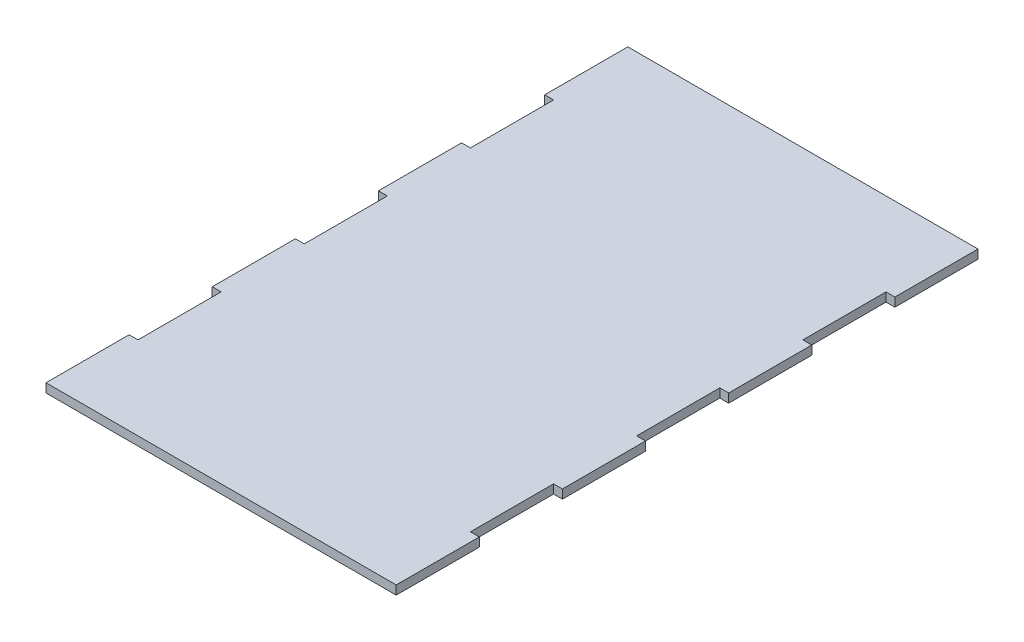
ISO-10303-21;
HEADER;
FILE_DESCRIPTION(('STEP AP214'),'2;1');
FILE_NAME('part.step','',(''),(''),'','','');
FILE_SCHEMA(('AUTOMOTIVE_DESIGN { 1 0 10303 214 1 1 1 1 }'));
ENDSEC;
DATA;
#1=APPLICATION_CONTEXT('core data for automotive mechanical design processes');
#2=APPLICATION_PROTOCOL_DEFINITION('international standard','automotive_design',2000,#1);
#3=PRODUCT_CONTEXT('',#1,'mechanical');
#4=PRODUCT('Part','Part','',(#3));
#5=PRODUCT_RELATED_PRODUCT_CATEGORY('part','',(#4));
#6=PRODUCT_DEFINITION_FORMATION('','',#4);
#7=PRODUCT_DEFINITION_CONTEXT('part definition',#1,'design');
#8=PRODUCT_DEFINITION('design','',#6,#7);
#9=PRODUCT_DEFINITION_SHAPE('','',#8);
#10=(LENGTH_UNIT() NAMED_UNIT(*) SI_UNIT(.MILLI.,.METRE.));
#11=(NAMED_UNIT(*) PLANE_ANGLE_UNIT() SI_UNIT($,.RADIAN.));
#12=(NAMED_UNIT(*) SI_UNIT($,.STERADIAN.) SOLID_ANGLE_UNIT());
#13=UNCERTAINTY_MEASURE_WITH_UNIT(LENGTH_MEASURE(1.E-05),#10,'distance_accuracy_value','');
#14=(GEOMETRIC_REPRESENTATION_CONTEXT(3) GLOBAL_UNCERTAINTY_ASSIGNED_CONTEXT((#13)) GLOBAL_UNIT_ASSIGNED_CONTEXT((#10,
#11,#12)) REPRESENTATION_CONTEXT('',''));
#15=CARTESIAN_POINT('',(0.,0.,0.));
#16=DIRECTION('',(0.,0.,1.));
#17=DIRECTION('',(1.,0.,0.));
#18=AXIS2_PLACEMENT_3D('',#15,#16,#17);
#19=CARTESIAN_POINT('',(0.,10.16,0.));
#20=DIRECTION('',(0.,0.,-1.));
#21=DIRECTION('',(-1.,0.,0.));
#22=AXIS2_PLACEMENT_3D('',#19,#20,#21);
#23=PLANE('',#22);
#24=DIRECTION('',(1.,0.,0.));
#25=VECTOR('',#24,1.);
#26=CARTESIAN_POINT('',(0.,0.,0.));
#27=LINE('',#26,#25);
#28=CARTESIAN_POINT('',(0.,0.,0.));
#29=VERTEX_POINT('',#28);
#30=CARTESIAN_POINT('',(401.32,0.,0.));
#31=VERTEX_POINT('',#30);
#32=EDGE_CURVE('E257',#29,#31,#27,.T.);
#33=ORIENTED_EDGE('',*,*,#32,.T.);
#34=DIRECTION('',(0.,-1.,0.));
#35=VECTOR('',#34,1.);
#36=CARTESIAN_POINT('',(401.32,10.16,0.));
#37=LINE('',#36,#35);
#38=CARTESIAN_POINT('',(401.32,10.16,0.));
#39=VERTEX_POINT('',#38);
#40=EDGE_CURVE('E11',#39,#31,#37,.T.);
#41=ORIENTED_EDGE('',*,*,#40,.F.);
#42=DIRECTION('',(1.,0.,0.));
#43=VECTOR('',#42,1.);
#44=CARTESIAN_POINT('',(0.,10.16,0.));
#45=LINE('',#44,#43);
#46=CARTESIAN_POINT('',(0.,10.16,0.));
#47=VERTEX_POINT('',#46);
#48=EDGE_CURVE('E324',#47,#39,#45,.T.);
#49=ORIENTED_EDGE('',*,*,#48,.F.);
#50=DIRECTION('',(0.,-1.,0.));
#51=VECTOR('',#50,1.);
#52=CARTESIAN_POINT('',(0.,10.16,0.));
#53=LINE('',#52,#51);
#54=EDGE_CURVE('E52',#47,#29,#53,.T.);
#55=ORIENTED_EDGE('',*,*,#54,.T.);
#56=EDGE_LOOP('',(#33,#41,#49,#55));
#57=FACE_BOUND('',#56,.T.);
#58=ADVANCED_FACE('F36',(#57),#23,.F.);
#59=CARTESIAN_POINT('',(401.32,10.16,0.));
#60=DIRECTION('',(-1.,0.,0.));
#61=DIRECTION('',(0.,0.,1.));
#62=AXIS2_PLACEMENT_3D('',#59,#60,#61);
#63=PLANE('',#62);
#64=DIRECTION('',(0.,0.,-1.));
#65=VECTOR('',#64,1.);
#66=CARTESIAN_POINT('',(401.32,0.,0.));
#67=LINE('',#66,#65);
#68=CARTESIAN_POINT('',(401.32,0.,-95.2500000000001));
#69=VERTEX_POINT('',#68);
#70=EDGE_CURVE('E259',#31,#69,#67,.T.);
#71=ORIENTED_EDGE('',*,*,#70,.T.);
#72=DIRECTION('',(0.,-1.,0.));
#73=VECTOR('',#72,1.);
#74=CARTESIAN_POINT('',(401.32,10.16,-95.2500000000001));
#75=LINE('',#74,#73);
#76=CARTESIAN_POINT('',(401.32,10.16,-95.2500000000001));
#77=VERTEX_POINT('',#76);
#78=EDGE_CURVE('E44',#77,#69,#75,.T.);
#79=ORIENTED_EDGE('',*,*,#78,.F.);
#80=DIRECTION('',(0.,0.,-1.));
#81=VECTOR('',#80,1.);
#82=CARTESIAN_POINT('',(401.32,10.16,0.));
#83=LINE('',#82,#81);
#84=EDGE_CURVE('E150',#39,#77,#83,.T.);
#85=ORIENTED_EDGE('',*,*,#84,.F.);
#86=ORIENTED_EDGE('',*,*,#40,.T.);
#87=EDGE_LOOP('',(#71,#79,#85,#86));
#88=FACE_BOUND('',#87,.T.);
#89=ADVANCED_FACE('F468',(#88),#63,.F.);
#90=CARTESIAN_POINT('',(-1.30104260698259E-13,10.16,-95.2499999999995));
#91=DIRECTION('',(0.,0.,1.));
#92=DIRECTION('',(1.,0.,0.));
#93=AXIS2_PLACEMENT_3D('',#90,#91,#92);
#94=PLANE('',#93);
#95=DIRECTION('',(-1.,0.,0.));
#96=VECTOR('',#95,1.);
#97=CARTESIAN_POINT('',(-1.30104260698259E-13,0.,-95.2499999999995));
#98=LINE('',#97,#96);
#99=CARTESIAN_POINT('',(391.16,0.,-95.25));
#100=VERTEX_POINT('',#99);
#101=EDGE_CURVE('E261',#69,#100,#98,.T.);
#102=ORIENTED_EDGE('',*,*,#101,.T.);
#103=DIRECTION('',(0.,-1.,0.));
#104=VECTOR('',#103,1.);
#105=CARTESIAN_POINT('',(391.16,10.16,-95.25));
#106=LINE('',#105,#104);
#107=CARTESIAN_POINT('',(391.16,10.16,-95.25));
#108=VERTEX_POINT('',#107);
#109=EDGE_CURVE('E374',#108,#100,#106,.T.);
#110=ORIENTED_EDGE('',*,*,#109,.F.);
#111=DIRECTION('',(-1.,0.,0.));
#112=VECTOR('',#111,1.);
#113=CARTESIAN_POINT('',(-1.30104260698259E-13,10.16,-95.2499999999995));
#114=LINE('',#113,#112);
#115=EDGE_CURVE('E381',#77,#108,#114,.T.);
#116=ORIENTED_EDGE('',*,*,#115,.F.);
#117=ORIENTED_EDGE('',*,*,#78,.T.);
#118=EDGE_LOOP('',(#102,#110,#116,#117));
#119=FACE_BOUND('',#118,.T.);
#120=ADVANCED_FACE('F379',(#119),#94,.F.);
#121=CARTESIAN_POINT('',(391.16,10.16,0.));
#122=DIRECTION('',(1.,0.,0.));
#123=DIRECTION('',(0.,0.,-1.));
#124=AXIS2_PLACEMENT_3D('',#121,#122,#123);
#125=PLANE('',#124);
#126=DIRECTION('',(0.,0.,1.));
#127=VECTOR('',#126,1.);
#128=CARTESIAN_POINT('',(391.16,0.,0.));
#129=LINE('',#128,#127);
#130=CARTESIAN_POINT('',(391.16,0.,-190.5));
#131=VERTEX_POINT('',#130);
#132=EDGE_CURVE('E264',#131,#100,#129,.T.);
#133=ORIENTED_EDGE('',*,*,#132,.F.);
#134=DIRECTION('',(0.,-1.,0.));
#135=VECTOR('',#134,1.);
#136=CARTESIAN_POINT('',(391.16,10.16,-190.5));
#137=LINE('',#136,#135);
#138=CARTESIAN_POINT('',(391.16,10.16,-190.5));
#139=VERTEX_POINT('',#138);
#140=EDGE_CURVE('E372',#139,#131,#137,.T.);
#141=ORIENTED_EDGE('',*,*,#140,.F.);
#142=DIRECTION('',(0.,0.,1.));
#143=VECTOR('',#142,1.);
#144=CARTESIAN_POINT('',(391.16,10.16,0.));
#145=LINE('',#144,#143);
#146=EDGE_CURVE('E391',#139,#108,#145,.T.);
#147=ORIENTED_EDGE('',*,*,#146,.T.);
#148=ORIENTED_EDGE('',*,*,#109,.T.);
#149=EDGE_LOOP('',(#133,#141,#147,#148));
#150=FACE_BOUND('',#149,.T.);
#151=ADVANCED_FACE('F388',(#150),#125,.T.);
#152=CARTESIAN_POINT('',(0.,10.16,-190.5));
#153=DIRECTION('',(0.,0.,1.));
#154=DIRECTION('',(1.,0.,0.));
#155=AXIS2_PLACEMENT_3D('',#152,#153,#154);
#156=PLANE('',#155);
#157=DIRECTION('',(-1.,0.,0.));
#158=VECTOR('',#157,1.);
#159=CARTESIAN_POINT('',(0.,0.,-190.5));
#160=LINE('',#159,#158);
#161=CARTESIAN_POINT('',(401.32,0.,-190.5));
#162=VERTEX_POINT('',#161);
#163=EDGE_CURVE('E267',#162,#131,#160,.T.);
#164=ORIENTED_EDGE('',*,*,#163,.F.);
#165=DIRECTION('',(0.,-1.,0.));
#166=VECTOR('',#165,1.);
#167=CARTESIAN_POINT('',(401.32,10.16,-190.5));
#168=LINE('',#167,#166);
#169=CARTESIAN_POINT('',(401.32,10.16,-190.5));
#170=VERTEX_POINT('',#169);
#171=EDGE_CURVE('E370',#170,#162,#168,.T.);
#172=ORIENTED_EDGE('',*,*,#171,.F.);
#173=DIRECTION('',(-1.,0.,0.));
#174=VECTOR('',#173,1.);
#175=CARTESIAN_POINT('',(0.,10.16,-190.5));
#176=LINE('',#175,#174);
#177=EDGE_CURVE('E394',#170,#139,#176,.T.);
#178=ORIENTED_EDGE('',*,*,#177,.T.);
#179=ORIENTED_EDGE('',*,*,#140,.T.);
#180=EDGE_LOOP('',(#164,#172,#178,#179));
#181=FACE_BOUND('',#180,.T.);
#182=ADVANCED_FACE('F721',(#181),#156,.T.);
#183=CARTESIAN_POINT('',(401.32,10.16,0.));
#184=DIRECTION('',(-1.,0.,0.));
#185=DIRECTION('',(0.,0.,1.));
#186=AXIS2_PLACEMENT_3D('',#183,#184,#185);
#187=PLANE('',#186);
#188=DIRECTION('',(0.,0.,-1.));
#189=VECTOR('',#188,1.);
#190=CARTESIAN_POINT('',(401.32,0.,0.));
#191=LINE('',#190,#189);
#192=CARTESIAN_POINT('',(401.32,0.,-285.75));
#193=VERTEX_POINT('',#192);
#194=EDGE_CURVE('E272',#162,#193,#191,.T.);
#195=ORIENTED_EDGE('',*,*,#194,.T.);
#196=DIRECTION('',(0.,-1.,0.));
#197=VECTOR('',#196,1.);
#198=CARTESIAN_POINT('',(401.32,10.16,-285.75));
#199=LINE('',#198,#197);
#200=CARTESIAN_POINT('',(401.32,10.16,-285.75));
#201=VERTEX_POINT('',#200);
#202=EDGE_CURVE('E367',#201,#193,#199,.T.);
#203=ORIENTED_EDGE('',*,*,#202,.F.);
#204=DIRECTION('',(0.,0.,-1.));
#205=VECTOR('',#204,1.);
#206=CARTESIAN_POINT('',(401.32,10.16,0.));
#207=LINE('',#206,#205);
#208=EDGE_CURVE('E398',#170,#201,#207,.T.);
#209=ORIENTED_EDGE('',*,*,#208,.F.);
#210=ORIENTED_EDGE('',*,*,#171,.T.);
#211=EDGE_LOOP('',(#195,#203,#209,#210));
#212=FACE_BOUND('',#211,.T.);
#213=ADVANCED_FACE('F709',(#212),#187,.F.);
#214=CARTESIAN_POINT('',(0.,10.16,-285.75));
#215=DIRECTION('',(0.,0.,1.));
#216=DIRECTION('',(1.,0.,0.));
#217=AXIS2_PLACEMENT_3D('',#214,#215,#216);
#218=PLANE('',#217);
#219=DIRECTION('',(-1.,0.,0.));
#220=VECTOR('',#219,1.);
#221=CARTESIAN_POINT('',(0.,0.,-285.75));
#222=LINE('',#221,#220);
#223=CARTESIAN_POINT('',(391.16,0.,-285.75));
#224=VERTEX_POINT('',#223);
#225=EDGE_CURVE('E274',#193,#224,#222,.T.);
#226=ORIENTED_EDGE('',*,*,#225,.T.);
#227=DIRECTION('',(0.,-1.,0.));
#228=VECTOR('',#227,1.);
#229=CARTESIAN_POINT('',(391.16,10.16,-285.75));
#230=LINE('',#229,#228);
#231=CARTESIAN_POINT('',(391.16,10.16,-285.75));
#232=VERTEX_POINT('',#231);
#233=EDGE_CURVE('E365',#232,#224,#230,.T.);
#234=ORIENTED_EDGE('',*,*,#233,.F.);
#235=DIRECTION('',(-1.,0.,0.));
#236=VECTOR('',#235,1.);
#237=CARTESIAN_POINT('',(0.,10.16,-285.75));
#238=LINE('',#237,#236);
#239=EDGE_CURVE('E406',#201,#232,#238,.T.);
#240=ORIENTED_EDGE('',*,*,#239,.F.);
#241=ORIENTED_EDGE('',*,*,#202,.T.);
#242=EDGE_LOOP('',(#226,#234,#240,#241));
#243=FACE_BOUND('',#242,.T.);
#244=ADVANCED_FACE('F700',(#243),#218,.F.);
#245=CARTESIAN_POINT('',(391.16,0.,-381.));
#246=VERTEX_POINT('',#245);
#247=EDGE_CURVE('E269',#246,#224,#129,.T.);
#248=ORIENTED_EDGE('',*,*,#247,.F.);
#249=DIRECTION('',(0.,-1.,0.));
#250=VECTOR('',#249,1.);
#251=CARTESIAN_POINT('',(391.16,10.16,-381.));
#252=LINE('',#251,#250);
#253=CARTESIAN_POINT('',(391.16,10.16,-381.));
#254=VERTEX_POINT('',#253);
#255=EDGE_CURVE('E363',#254,#246,#252,.T.);
#256=ORIENTED_EDGE('',*,*,#255,.F.);
#257=EDGE_CURVE('E397',#254,#232,#145,.T.);
#258=ORIENTED_EDGE('',*,*,#257,.T.);
#259=ORIENTED_EDGE('',*,*,#233,.T.);
#260=EDGE_LOOP('',(#248,#256,#258,#259));
#261=FACE_BOUND('',#260,.T.);
#262=ADVANCED_FACE('F657',(#261),#125,.T.);
#263=CARTESIAN_POINT('',(0.,10.16,-381.));
#264=DIRECTION('',(0.,0.,1.));
#265=DIRECTION('',(1.,0.,0.));
#266=AXIS2_PLACEMENT_3D('',#263,#264,#265);
#267=PLANE('',#266);
#268=DIRECTION('',(-1.,0.,0.));
#269=VECTOR('',#268,1.);
#270=CARTESIAN_POINT('',(0.,0.,-381.));
#271=LINE('',#270,#269);
#272=CARTESIAN_POINT('',(401.32,0.,-381.));
#273=VERTEX_POINT('',#272);
#274=EDGE_CURVE('E277',#273,#246,#271,.T.);
#275=ORIENTED_EDGE('',*,*,#274,.F.);
#276=DIRECTION('',(0.,-1.,0.));
#277=VECTOR('',#276,1.);
#278=CARTESIAN_POINT('',(401.32,10.16,-381.));
#279=LINE('',#278,#277);
#280=CARTESIAN_POINT('',(401.32,10.16,-381.));
#281=VERTEX_POINT('',#280);
#282=EDGE_CURVE('E361',#281,#273,#279,.T.);
#283=ORIENTED_EDGE('',*,*,#282,.F.);
#284=DIRECTION('',(-1.,0.,0.));
#285=VECTOR('',#284,1.);
#286=CARTESIAN_POINT('',(0.,10.16,-381.));
#287=LINE('',#286,#285);
#288=EDGE_CURVE('E405',#281,#254,#287,.T.);
#289=ORIENTED_EDGE('',*,*,#288,.T.);
#290=ORIENTED_EDGE('',*,*,#255,.T.);
#291=EDGE_LOOP('',(#275,#283,#289,#290));
#292=FACE_BOUND('',#291,.T.);
#293=ADVANCED_FACE('F678',(#292),#267,.T.);
#294=CARTESIAN_POINT('',(401.32,10.16,0.));
#295=DIRECTION('',(-1.,0.,0.));
#296=DIRECTION('',(0.,0.,1.));
#297=AXIS2_PLACEMENT_3D('',#294,#295,#296);
#298=PLANE('',#297);
#299=DIRECTION('',(0.,0.,-1.));
#300=VECTOR('',#299,1.);
#301=CARTESIAN_POINT('',(401.32,0.,0.));
#302=LINE('',#301,#300);
#303=CARTESIAN_POINT('',(401.32,0.,-476.25));
#304=VERTEX_POINT('',#303);
#305=EDGE_CURVE('E280',#273,#304,#302,.T.);
#306=ORIENTED_EDGE('',*,*,#305,.T.);
#307=DIRECTION('',(0.,-1.,0.));
#308=VECTOR('',#307,1.);
#309=CARTESIAN_POINT('',(401.32,10.16,-476.25));
#310=LINE('',#309,#308);
#311=CARTESIAN_POINT('',(401.32,10.16,-476.25));
#312=VERTEX_POINT('',#311);
#313=EDGE_CURVE('E358',#312,#304,#310,.T.);
#314=ORIENTED_EDGE('',*,*,#313,.F.);
#315=DIRECTION('',(0.,0.,-1.));
#316=VECTOR('',#315,1.);
#317=CARTESIAN_POINT('',(401.32,10.16,0.));
#318=LINE('',#317,#316);
#319=EDGE_CURVE('E410',#281,#312,#318,.T.);
#320=ORIENTED_EDGE('',*,*,#319,.F.);
#321=ORIENTED_EDGE('',*,*,#282,.T.);
#322=EDGE_LOOP('',(#306,#314,#320,#321));
#323=FACE_BOUND('',#322,.T.);
#324=ADVANCED_FACE('F666',(#323),#298,.F.);
#325=CARTESIAN_POINT('',(0.,10.16,-476.25));
#326=DIRECTION('',(0.,0.,1.));
#327=DIRECTION('',(1.,0.,0.));
#328=AXIS2_PLACEMENT_3D('',#325,#326,#327);
#329=PLANE('',#328);
#330=DIRECTION('',(-1.,0.,0.));
#331=VECTOR('',#330,1.);
#332=CARTESIAN_POINT('',(0.,0.,-476.25));
#333=LINE('',#332,#331);
#334=CARTESIAN_POINT('',(391.16,0.,-476.25));
#335=VERTEX_POINT('',#334);
#336=EDGE_CURVE('E282',#304,#335,#333,.T.);
#337=ORIENTED_EDGE('',*,*,#336,.T.);
#338=DIRECTION('',(0.,-1.,0.));
#339=VECTOR('',#338,1.);
#340=CARTESIAN_POINT('',(391.16,10.16,-476.25));
#341=LINE('',#340,#339);
#342=CARTESIAN_POINT('',(391.16,10.16,-476.25));
#343=VERTEX_POINT('',#342);
#344=EDGE_CURVE('E356',#343,#335,#341,.T.);
#345=ORIENTED_EDGE('',*,*,#344,.F.);
#346=DIRECTION('',(-1.,0.,0.));
#347=VECTOR('',#346,1.);
#348=CARTESIAN_POINT('',(0.,10.16,-476.25));
#349=LINE('',#348,#347);
#350=EDGE_CURVE('E403',#312,#343,#349,.T.);
#351=ORIENTED_EDGE('',*,*,#350,.F.);
#352=ORIENTED_EDGE('',*,*,#313,.T.);
#353=EDGE_LOOP('',(#337,#345,#351,#352));
#354=FACE_BOUND('',#353,.T.);
#355=ADVANCED_FACE('F654',(#354),#329,.F.);
#356=CARTESIAN_POINT('',(391.16,0.,-571.5));
#357=VERTEX_POINT('',#356);
#358=EDGE_CURVE('E268',#357,#335,#129,.T.);
#359=ORIENTED_EDGE('',*,*,#358,.F.);
#360=DIRECTION('',(0.,-1.,0.));
#361=VECTOR('',#360,1.);
#362=CARTESIAN_POINT('',(391.16,10.16,-571.5));
#363=LINE('',#362,#361);
#364=CARTESIAN_POINT('',(391.16,10.16,-571.5));
#365=VERTEX_POINT('',#364);
#366=EDGE_CURVE('E354',#365,#357,#363,.T.);
#367=ORIENTED_EDGE('',*,*,#366,.F.);
#368=EDGE_CURVE('E396',#365,#343,#145,.T.);
#369=ORIENTED_EDGE('',*,*,#368,.T.);
#370=ORIENTED_EDGE('',*,*,#344,.T.);
#371=EDGE_LOOP('',(#359,#367,#369,#370));
#372=FACE_BOUND('',#371,.T.);
#373=ADVANCED_FACE('F642',(#372),#125,.T.);
#374=CARTESIAN_POINT('',(0.,10.16,-571.5));
#375=DIRECTION('',(0.,0.,1.));
#376=DIRECTION('',(1.,0.,0.));
#377=AXIS2_PLACEMENT_3D('',#374,#375,#376);
#378=PLANE('',#377);
#379=DIRECTION('',(-1.,0.,0.));
#380=VECTOR('',#379,1.);
#381=CARTESIAN_POINT('',(0.,0.,-571.5));
#382=LINE('',#381,#380);
#383=CARTESIAN_POINT('',(401.32,0.,-571.5));
#384=VERTEX_POINT('',#383);
#385=EDGE_CURVE('E285',#384,#357,#382,.T.);
#386=ORIENTED_EDGE('',*,*,#385,.F.);
#387=DIRECTION('',(0.,-1.,0.));
#388=VECTOR('',#387,1.);
#389=CARTESIAN_POINT('',(401.32,10.16,-571.5));
#390=LINE('',#389,#388);
#391=CARTESIAN_POINT('',(401.32,10.16,-571.5));
#392=VERTEX_POINT('',#391);
#393=EDGE_CURVE('E352',#392,#384,#390,.T.);
#394=ORIENTED_EDGE('',*,*,#393,.F.);
#395=DIRECTION('',(-1.,0.,0.));
#396=VECTOR('',#395,1.);
#397=CARTESIAN_POINT('',(0.,10.16,-571.5));
#398=LINE('',#397,#396);
#399=EDGE_CURVE('E402',#392,#365,#398,.T.);
#400=ORIENTED_EDGE('',*,*,#399,.T.);
#401=ORIENTED_EDGE('',*,*,#366,.T.);
#402=EDGE_LOOP('',(#386,#394,#400,#401));
#403=FACE_BOUND('',#402,.T.);
#404=ADVANCED_FACE('F630',(#403),#378,.T.);
#405=CARTESIAN_POINT('',(401.32,10.16,0.));
#406=DIRECTION('',(-1.,0.,0.));
#407=DIRECTION('',(0.,0.,1.));
#408=AXIS2_PLACEMENT_3D('',#405,#406,#407);
#409=PLANE('',#408);
#410=DIRECTION('',(0.,0.,-1.));
#411=VECTOR('',#410,1.);
#412=CARTESIAN_POINT('',(401.32,0.,0.));
#413=LINE('',#412,#411);
#414=CARTESIAN_POINT('',(401.32,0.,-666.75));
#415=VERTEX_POINT('',#414);
#416=EDGE_CURVE('E288',#384,#415,#413,.T.);
#417=ORIENTED_EDGE('',*,*,#416,.T.);
#418=DIRECTION('',(0.,-1.,0.));
#419=VECTOR('',#418,1.);
#420=CARTESIAN_POINT('',(401.32,10.16,-666.75));
#421=LINE('',#420,#419);
#422=CARTESIAN_POINT('',(401.32,10.16,-666.75));
#423=VERTEX_POINT('',#422);
#424=EDGE_CURVE('E350',#423,#415,#421,.T.);
#425=ORIENTED_EDGE('',*,*,#424,.F.);
#426=DIRECTION('',(0.,0.,-1.));
#427=VECTOR('',#426,1.);
#428=CARTESIAN_POINT('',(401.32,10.16,0.));
#429=LINE('',#428,#427);
#430=EDGE_CURVE('E421',#392,#423,#429,.T.);
#431=ORIENTED_EDGE('',*,*,#430,.F.);
#432=ORIENTED_EDGE('',*,*,#393,.T.);
#433=EDGE_LOOP('',(#417,#425,#431,#432));
#434=FACE_BOUND('',#433,.T.);
#435=ADVANCED_FACE('F619',(#434),#409,.F.);
#436=CARTESIAN_POINT('',(0.,10.16,-666.75));
#437=DIRECTION('',(0.,0.,-1.));
#438=DIRECTION('',(-1.,0.,0.));
#439=AXIS2_PLACEMENT_3D('',#436,#437,#438);
#440=PLANE('',#439);
#441=DIRECTION('',(1.,0.,0.));
#442=VECTOR('',#441,1.);
#443=CARTESIAN_POINT('',(0.,0.,-666.75));
#444=LINE('',#443,#442);
#445=CARTESIAN_POINT('',(0.,0.,-666.75));
#446=VERTEX_POINT('',#445);
#447=EDGE_CURVE('E291',#446,#415,#444,.T.);
#448=ORIENTED_EDGE('',*,*,#447,.F.);
#449=DIRECTION('',(0.,-1.,0.));
#450=VECTOR('',#449,1.);
#451=CARTESIAN_POINT('',(0.,10.16,-666.75));
#452=LINE('',#451,#450);
#453=CARTESIAN_POINT('',(0.,10.16,-666.75));
#454=VERTEX_POINT('',#453);
#455=EDGE_CURVE('E348',#454,#446,#452,.T.);
#456=ORIENTED_EDGE('',*,*,#455,.F.);
#457=DIRECTION('',(1.,0.,0.));
#458=VECTOR('',#457,1.);
#459=CARTESIAN_POINT('',(0.,10.16,-666.75));
#460=LINE('',#459,#458);
#461=EDGE_CURVE('E423',#454,#423,#460,.T.);
#462=ORIENTED_EDGE('',*,*,#461,.T.);
#463=ORIENTED_EDGE('',*,*,#424,.T.);
#464=EDGE_LOOP('',(#448,#456,#462,#463));
#465=FACE_BOUND('',#464,.T.);
#466=ADVANCED_FACE('F608',(#465),#440,.T.);
#467=CARTESIAN_POINT('',(0.,10.16,0.));
#468=DIRECTION('',(-1.,0.,0.));
#469=DIRECTION('',(0.,0.,1.));
#470=AXIS2_PLACEMENT_3D('',#467,#468,#469);
#471=PLANE('',#470);
#472=DIRECTION('',(0.,0.,-1.));
#473=VECTOR('',#472,1.);
#474=CARTESIAN_POINT('',(0.,0.,0.));
#475=LINE('',#474,#473);
#476=CARTESIAN_POINT('',(0.,0.,-571.5));
#477=VERTEX_POINT('',#476);
#478=EDGE_CURVE('E294',#477,#446,#475,.T.);
#479=ORIENTED_EDGE('',*,*,#478,.F.);
#480=DIRECTION('',(0.,-1.,0.));
#481=VECTOR('',#480,1.);
#482=CARTESIAN_POINT('',(0.,10.16,-571.5));
#483=LINE('',#482,#481);
#484=CARTESIAN_POINT('',(0.,10.16,-571.5));
#485=VERTEX_POINT('',#484);
#486=EDGE_CURVE('E346',#485,#477,#483,.T.);
#487=ORIENTED_EDGE('',*,*,#486,.F.);
#488=DIRECTION('',(0.,0.,-1.));
#489=VECTOR('',#488,1.);
#490=CARTESIAN_POINT('',(0.,10.16,0.));
#491=LINE('',#490,#489);
#492=EDGE_CURVE('E426',#485,#454,#491,.T.);
#493=ORIENTED_EDGE('',*,*,#492,.T.);
#494=ORIENTED_EDGE('',*,*,#455,.T.);
#495=EDGE_LOOP('',(#479,#487,#493,#494));
#496=FACE_BOUND('',#495,.T.);
#497=ADVANCED_FACE('F596',(#496),#471,.T.);
#498=CARTESIAN_POINT('',(0.,10.16,-571.5));
#499=DIRECTION('',(0.,0.,-1.));
#500=DIRECTION('',(-1.,0.,0.));
#501=AXIS2_PLACEMENT_3D('',#498,#499,#500);
#502=PLANE('',#501);
#503=DIRECTION('',(1.,0.,0.));
#504=VECTOR('',#503,1.);
#505=CARTESIAN_POINT('',(0.,0.,-571.5));
#506=LINE('',#505,#504);
#507=CARTESIAN_POINT('',(10.16,0.,-571.5));
#508=VERTEX_POINT('',#507);
#509=EDGE_CURVE('E297',#477,#508,#506,.T.);
#510=ORIENTED_EDGE('',*,*,#509,.T.);
#511=DIRECTION('',(0.,-1.,0.));
#512=VECTOR('',#511,1.);
#513=CARTESIAN_POINT('',(10.16,10.16,-571.5));
#514=LINE('',#513,#512);
#515=CARTESIAN_POINT('',(10.16,10.16,-571.5));
#516=VERTEX_POINT('',#515);
#517=EDGE_CURVE('E343',#516,#508,#514,.T.);
#518=ORIENTED_EDGE('',*,*,#517,.F.);
#519=DIRECTION('',(1.,0.,0.));
#520=VECTOR('',#519,1.);
#521=CARTESIAN_POINT('',(0.,10.16,-571.5));
#522=LINE('',#521,#520);
#523=EDGE_CURVE('E429',#485,#516,#522,.T.);
#524=ORIENTED_EDGE('',*,*,#523,.F.);
#525=ORIENTED_EDGE('',*,*,#486,.T.);
#526=EDGE_LOOP('',(#510,#518,#524,#525));
#527=FACE_BOUND('',#526,.T.);
#528=ADVANCED_FACE('F586',(#527),#502,.F.);
#529=CARTESIAN_POINT('',(10.1600000000001,10.16,0.));
#530=DIRECTION('',(1.,0.,0.));
#531=DIRECTION('',(0.,0.,-1.));
#532=AXIS2_PLACEMENT_3D('',#529,#530,#531);
#533=PLANE('',#532);
#534=DIRECTION('',(0.,0.,1.));
#535=VECTOR('',#534,1.);
#536=CARTESIAN_POINT('',(10.1600000000001,0.,0.));
#537=LINE('',#536,#535);
#538=CARTESIAN_POINT('',(10.16,0.,-476.25));
#539=VERTEX_POINT('',#538);
#540=EDGE_CURVE('E299',#508,#539,#537,.T.);
#541=ORIENTED_EDGE('',*,*,#540,.T.);
#542=DIRECTION('',(0.,-1.,0.));
#543=VECTOR('',#542,1.);
#544=CARTESIAN_POINT('',(10.16,10.16,-476.25));
#545=LINE('',#544,#543);
#546=CARTESIAN_POINT('',(10.16,10.16,-476.25));
#547=VERTEX_POINT('',#546);
#548=EDGE_CURVE('E341',#547,#539,#545,.T.);
#549=ORIENTED_EDGE('',*,*,#548,.F.);
#550=DIRECTION('',(0.,0.,1.));
#551=VECTOR('',#550,1.);
#552=CARTESIAN_POINT('',(10.1600000000001,10.16,0.));
#553=LINE('',#552,#551);
#554=EDGE_CURVE('E240',#516,#547,#553,.T.);
#555=ORIENTED_EDGE('',*,*,#554,.F.);
#556=ORIENTED_EDGE('',*,*,#517,.T.);
#557=EDGE_LOOP('',(#541,#549,#555,#556));
#558=FACE_BOUND('',#557,.T.);
#559=ADVANCED_FACE('F464',(#558),#533,.F.);
#560=CARTESIAN_POINT('',(0.,10.16,-476.25));
#561=DIRECTION('',(0.,0.,-1.));
#562=DIRECTION('',(-1.,0.,0.));
#563=AXIS2_PLACEMENT_3D('',#560,#561,#562);
#564=PLANE('',#563);
#565=DIRECTION('',(1.,0.,0.));
#566=VECTOR('',#565,1.);
#567=CARTESIAN_POINT('',(0.,0.,-476.25));
#568=LINE('',#567,#566);
#569=CARTESIAN_POINT('',(0.,0.,-476.25));
#570=VERTEX_POINT('',#569);
#571=EDGE_CURVE('E302',#570,#539,#568,.T.);
#572=ORIENTED_EDGE('',*,*,#571,.F.);
#573=DIRECTION('',(0.,-1.,0.));
#574=VECTOR('',#573,1.);
#575=CARTESIAN_POINT('',(0.,10.16,-476.25));
#576=LINE('',#575,#574);
#577=CARTESIAN_POINT('',(0.,10.16,-476.25));
#578=VERTEX_POINT('',#577);
#579=EDGE_CURVE('E339',#578,#570,#576,.T.);
#580=ORIENTED_EDGE('',*,*,#579,.F.);
#581=DIRECTION('',(1.,0.,0.));
#582=VECTOR('',#581,1.);
#583=CARTESIAN_POINT('',(0.,10.16,-476.25));
#584=LINE('',#583,#582);
#585=EDGE_CURVE('E431',#578,#547,#584,.T.);
#586=ORIENTED_EDGE('',*,*,#585,.T.);
#587=ORIENTED_EDGE('',*,*,#548,.T.);
#588=EDGE_LOOP('',(#572,#580,#586,#587));
#589=FACE_BOUND('',#588,.T.);
#590=ADVANCED_FACE('F565',(#589),#564,.T.);
#591=CARTESIAN_POINT('',(0.,10.16,0.));
#592=DIRECTION('',(-1.,0.,0.));
#593=DIRECTION('',(0.,0.,1.));
#594=AXIS2_PLACEMENT_3D('',#591,#592,#593);
#595=PLANE('',#594);
#596=DIRECTION('',(0.,0.,-1.));
#597=VECTOR('',#596,1.);
#598=CARTESIAN_POINT('',(0.,0.,0.));
#599=LINE('',#598,#597);
#600=CARTESIAN_POINT('',(0.,0.,-381.));
#601=VERTEX_POINT('',#600);
#602=EDGE_CURVE('E306',#601,#570,#599,.T.);
#603=ORIENTED_EDGE('',*,*,#602,.F.);
#604=DIRECTION('',(0.,-1.,0.));
#605=VECTOR('',#604,1.);
#606=CARTESIAN_POINT('',(0.,10.16,-381.));
#607=LINE('',#606,#605);
#608=CARTESIAN_POINT('',(0.,10.16,-381.));
#609=VERTEX_POINT('',#608);
#610=EDGE_CURVE('E337',#609,#601,#607,.T.);
#611=ORIENTED_EDGE('',*,*,#610,.F.);
#612=DIRECTION('',(0.,0.,-1.));
#613=VECTOR('',#612,1.);
#614=CARTESIAN_POINT('',(0.,10.16,0.));
#615=LINE('',#614,#613);
#616=EDGE_CURVE('E434',#609,#578,#615,.T.);
#617=ORIENTED_EDGE('',*,*,#616,.T.);
#618=ORIENTED_EDGE('',*,*,#579,.T.);
#619=EDGE_LOOP('',(#603,#611,#617,#618));
#620=FACE_BOUND('',#619,.T.);
#621=ADVANCED_FACE('F553',(#620),#595,.T.);
#622=CARTESIAN_POINT('',(0.,10.16,-381.));
#623=DIRECTION('',(0.,0.,-1.));
#624=DIRECTION('',(-1.,0.,0.));
#625=AXIS2_PLACEMENT_3D('',#622,#623,#624);
#626=PLANE('',#625);
#627=DIRECTION('',(1.,0.,0.));
#628=VECTOR('',#627,1.);
#629=CARTESIAN_POINT('',(0.,0.,-381.));
#630=LINE('',#629,#628);
#631=CARTESIAN_POINT('',(10.16,0.,-381.));
#632=VERTEX_POINT('',#631);
#633=EDGE_CURVE('E309',#601,#632,#630,.T.);
#634=ORIENTED_EDGE('',*,*,#633,.T.);
#635=DIRECTION('',(0.,-1.,0.));
#636=VECTOR('',#635,1.);
#637=CARTESIAN_POINT('',(10.16,10.16,-381.));
#638=LINE('',#637,#636);
#639=CARTESIAN_POINT('',(10.16,10.16,-381.));
#640=VERTEX_POINT('',#639);
#641=EDGE_CURVE('E334',#640,#632,#638,.T.);
#642=ORIENTED_EDGE('',*,*,#641,.F.);
#643=DIRECTION('',(1.,0.,0.));
#644=VECTOR('',#643,1.);
#645=CARTESIAN_POINT('',(0.,10.16,-381.));
#646=LINE('',#645,#644);
#647=EDGE_CURVE('E437',#609,#640,#646,.T.);
#648=ORIENTED_EDGE('',*,*,#647,.F.);
#649=ORIENTED_EDGE('',*,*,#610,.T.);
#650=EDGE_LOOP('',(#634,#642,#648,#649));
#651=FACE_BOUND('',#650,.T.);
#652=ADVANCED_FACE('F543',(#651),#626,.F.);
#653=CARTESIAN_POINT('',(10.16,0.,-285.75));
#654=VERTEX_POINT('',#653);
#655=EDGE_CURVE('E303',#632,#654,#537,.T.);
#656=ORIENTED_EDGE('',*,*,#655,.T.);
#657=DIRECTION('',(0.,-1.,0.));
#658=VECTOR('',#657,1.);
#659=CARTESIAN_POINT('',(10.16,10.16,-285.75));
#660=LINE('',#659,#658);
#661=CARTESIAN_POINT('',(10.16,10.16,-285.75));
#662=VERTEX_POINT('',#661);
#663=EDGE_CURVE('E332',#662,#654,#660,.T.);
#664=ORIENTED_EDGE('',*,*,#663,.F.);
#665=EDGE_CURVE('E239',#640,#662,#553,.T.);
#666=ORIENTED_EDGE('',*,*,#665,.F.);
#667=ORIENTED_EDGE('',*,*,#641,.T.);
#668=EDGE_LOOP('',(#656,#664,#666,#667));
#669=FACE_BOUND('',#668,.T.);
#670=ADVANCED_FACE('F465',(#669),#533,.F.);
#671=CARTESIAN_POINT('',(0.,10.16,-285.75));
#672=DIRECTION('',(0.,0.,-1.));
#673=DIRECTION('',(-1.,0.,0.));
#674=AXIS2_PLACEMENT_3D('',#671,#672,#673);
#675=PLANE('',#674);
#676=DIRECTION('',(1.,0.,0.));
#677=VECTOR('',#676,1.);
#678=CARTESIAN_POINT('',(0.,0.,-285.75));
#679=LINE('',#678,#677);
#680=CARTESIAN_POINT('',(0.,0.,-285.75));
#681=VERTEX_POINT('',#680);
#682=EDGE_CURVE('E311',#681,#654,#679,.T.);
#683=ORIENTED_EDGE('',*,*,#682,.F.);
#684=DIRECTION('',(0.,-1.,0.));
#685=VECTOR('',#684,1.);
#686=CARTESIAN_POINT('',(0.,10.16,-285.75));
#687=LINE('',#686,#685);
#688=CARTESIAN_POINT('',(0.,10.16,-285.75));
#689=VERTEX_POINT('',#688);
#690=EDGE_CURVE('E330',#689,#681,#687,.T.);
#691=ORIENTED_EDGE('',*,*,#690,.F.);
#692=DIRECTION('',(1.,0.,0.));
#693=VECTOR('',#692,1.);
#694=CARTESIAN_POINT('',(0.,10.16,-285.75));
#695=LINE('',#694,#693);
#696=EDGE_CURVE('E439',#689,#662,#695,.T.);
#697=ORIENTED_EDGE('',*,*,#696,.T.);
#698=ORIENTED_EDGE('',*,*,#663,.T.);
#699=EDGE_LOOP('',(#683,#691,#697,#698));
#700=FACE_BOUND('',#699,.T.);
#701=ADVANCED_FACE('F451',(#700),#675,.T.);
#702=CARTESIAN_POINT('',(0.,10.16,0.));
#703=DIRECTION('',(-1.,0.,0.));
#704=DIRECTION('',(0.,0.,1.));
#705=AXIS2_PLACEMENT_3D('',#702,#703,#704);
#706=PLANE('',#705);
#707=DIRECTION('',(0.,0.,-1.));
#708=VECTOR('',#707,1.);
#709=CARTESIAN_POINT('',(0.,0.,0.));
#710=LINE('',#709,#708);
#711=CARTESIAN_POINT('',(0.,0.,-190.5));
#712=VERTEX_POINT('',#711);
#713=EDGE_CURVE('E314',#712,#681,#710,.T.);
#714=ORIENTED_EDGE('',*,*,#713,.F.);
#715=DIRECTION('',(0.,-1.,0.));
#716=VECTOR('',#715,1.);
#717=CARTESIAN_POINT('',(0.,10.16,-190.5));
#718=LINE('',#717,#716);
#719=CARTESIAN_POINT('',(0.,10.16,-190.5));
#720=VERTEX_POINT('',#719);
#721=EDGE_CURVE('E328',#720,#712,#718,.T.);
#722=ORIENTED_EDGE('',*,*,#721,.F.);
#723=DIRECTION('',(0.,0.,-1.));
#724=VECTOR('',#723,1.);
#725=CARTESIAN_POINT('',(0.,10.16,0.));
#726=LINE('',#725,#724);
#727=EDGE_CURVE('E441',#720,#689,#726,.T.);
#728=ORIENTED_EDGE('',*,*,#727,.T.);
#729=ORIENTED_EDGE('',*,*,#690,.T.);
#730=EDGE_LOOP('',(#714,#722,#728,#729));
#731=FACE_BOUND('',#730,.T.);
#732=ADVANCED_FACE('F445',(#731),#706,.T.);
#733=CARTESIAN_POINT('',(0.,10.16,-190.5));
#734=DIRECTION('',(0.,0.,-1.));
#735=DIRECTION('',(-1.,0.,0.));
#736=AXIS2_PLACEMENT_3D('',#733,#734,#735);
#737=PLANE('',#736);
#738=DIRECTION('',(1.,0.,0.));
#739=VECTOR('',#738,1.);
#740=CARTESIAN_POINT('',(0.,0.,-190.5));
#741=LINE('',#740,#739);
#742=CARTESIAN_POINT('',(10.16,0.,-190.5));
#743=VERTEX_POINT('',#742);
#744=EDGE_CURVE('E317',#712,#743,#741,.T.);
#745=ORIENTED_EDGE('',*,*,#744,.T.);
#746=DIRECTION('',(0.,-1.,0.));
#747=VECTOR('',#746,1.);
#748=CARTESIAN_POINT('',(10.16,10.16,-190.5));
#749=LINE('',#748,#747);
#750=CARTESIAN_POINT('',(10.16,10.16,-190.5));
#751=VERTEX_POINT('',#750);
#752=EDGE_CURVE('E248',#751,#743,#749,.T.);
#753=ORIENTED_EDGE('',*,*,#752,.F.);
#754=DIRECTION('',(1.,0.,0.));
#755=VECTOR('',#754,1.);
#756=CARTESIAN_POINT('',(0.,10.16,-190.5));
#757=LINE('',#756,#755);
#758=EDGE_CURVE('E234',#720,#751,#757,.T.);
#759=ORIENTED_EDGE('',*,*,#758,.F.);
#760=ORIENTED_EDGE('',*,*,#721,.T.);
#761=EDGE_LOOP('',(#745,#753,#759,#760));
#762=FACE_BOUND('',#761,.T.);
#763=ADVANCED_FACE('F456',(#762),#737,.F.);
#764=CARTESIAN_POINT('',(10.16,0.,-95.25));
#765=VERTEX_POINT('',#764);
#766=EDGE_CURVE('E245',#743,#765,#537,.T.);
#767=ORIENTED_EDGE('',*,*,#766,.T.);
#768=DIRECTION('',(0.,-1.,0.));
#769=VECTOR('',#768,1.);
#770=CARTESIAN_POINT('',(10.16,10.16,-95.25));
#771=LINE('',#770,#769);
#772=CARTESIAN_POINT('',(10.16,10.16,-95.25));
#773=VERTEX_POINT('',#772);
#774=EDGE_CURVE('E242',#773,#765,#771,.T.);
#775=ORIENTED_EDGE('',*,*,#774,.F.);
#776=EDGE_CURVE('E226',#751,#773,#553,.T.);
#777=ORIENTED_EDGE('',*,*,#776,.F.);
#778=ORIENTED_EDGE('',*,*,#752,.T.);
#779=EDGE_LOOP('',(#767,#775,#777,#778));
#780=FACE_BOUND('',#779,.T.);
#781=ADVANCED_FACE('F243',(#780),#533,.F.);
#782=CARTESIAN_POINT('',(0.,10.16,-95.25));
#783=DIRECTION('',(0.,0.,-1.));
#784=DIRECTION('',(-1.,0.,0.));
#785=AXIS2_PLACEMENT_3D('',#782,#783,#784);
#786=PLANE('',#785);
#787=DIRECTION('',(1.,0.,0.));
#788=VECTOR('',#787,1.);
#789=CARTESIAN_POINT('',(0.,0.,-95.25));
#790=LINE('',#789,#788);
#791=CARTESIAN_POINT('',(0.,0.,-95.25));
#792=VERTEX_POINT('',#791);
#793=EDGE_CURVE('E319',#792,#765,#790,.T.);
#794=ORIENTED_EDGE('',*,*,#793,.F.);
#795=DIRECTION('',(0.,-1.,0.));
#796=VECTOR('',#795,1.);
#797=CARTESIAN_POINT('',(0.,10.16,-95.25));
#798=LINE('',#797,#796);
#799=CARTESIAN_POINT('',(0.,10.16,-95.25));
#800=VERTEX_POINT('',#799);
#801=EDGE_CURVE('E138',#800,#792,#798,.T.);
#802=ORIENTED_EDGE('',*,*,#801,.F.);
#803=DIRECTION('',(1.,0.,0.));
#804=VECTOR('',#803,1.);
#805=CARTESIAN_POINT('',(0.,10.16,-95.25));
#806=LINE('',#805,#804);
#807=EDGE_CURVE('E231',#800,#773,#806,.T.);
#808=ORIENTED_EDGE('',*,*,#807,.T.);
#809=ORIENTED_EDGE('',*,*,#774,.T.);
#810=EDGE_LOOP('',(#794,#802,#808,#809));
#811=FACE_BOUND('',#810,.T.);
#812=ADVANCED_FACE('F250',(#811),#786,.T.);
#813=CARTESIAN_POINT('',(0.,10.16,0.));
#814=DIRECTION('',(-1.,0.,0.));
#815=DIRECTION('',(0.,0.,1.));
#816=AXIS2_PLACEMENT_3D('',#813,#814,#815);
#817=PLANE('',#816);
#818=DIRECTION('',(0.,0.,-1.));
#819=VECTOR('',#818,1.);
#820=CARTESIAN_POINT('',(0.,0.,0.));
#821=LINE('',#820,#819);
#822=EDGE_CURVE('E321',#29,#792,#821,.T.);
#823=ORIENTED_EDGE('',*,*,#822,.F.);
#824=ORIENTED_EDGE('',*,*,#54,.F.);
#825=DIRECTION('',(0.,0.,-1.));
#826=VECTOR('',#825,1.);
#827=CARTESIAN_POINT('',(0.,10.16,0.));
#828=LINE('',#827,#826);
#829=EDGE_CURVE('E251',#47,#800,#828,.T.);
#830=ORIENTED_EDGE('',*,*,#829,.T.);
#831=ORIENTED_EDGE('',*,*,#801,.T.);
#832=EDGE_LOOP('',(#823,#824,#830,#831));
#833=FACE_BOUND('',#832,.T.);
#834=ADVANCED_FACE('F473',(#833),#817,.T.);
#835=CARTESIAN_POINT('',(0.,10.16,0.));
#836=DIRECTION('',(0.,1.,0.));
#837=DIRECTION('',(0.,0.,1.));
#838=AXIS2_PLACEMENT_3D('',#835,#836,#837);
#839=PLANE('',#838);
#840=ORIENTED_EDGE('',*,*,#48,.T.);
#841=ORIENTED_EDGE('',*,*,#84,.T.);
#842=ORIENTED_EDGE('',*,*,#115,.T.);
#843=ORIENTED_EDGE('',*,*,#146,.F.);
#844=ORIENTED_EDGE('',*,*,#177,.F.);
#845=ORIENTED_EDGE('',*,*,#208,.T.);
#846=ORIENTED_EDGE('',*,*,#239,.T.);
#847=ORIENTED_EDGE('',*,*,#257,.F.);
#848=ORIENTED_EDGE('',*,*,#288,.F.);
#849=ORIENTED_EDGE('',*,*,#319,.T.);
#850=ORIENTED_EDGE('',*,*,#350,.T.);
#851=ORIENTED_EDGE('',*,*,#368,.F.);
#852=ORIENTED_EDGE('',*,*,#399,.F.);
#853=ORIENTED_EDGE('',*,*,#430,.T.);
#854=ORIENTED_EDGE('',*,*,#461,.F.);
#855=ORIENTED_EDGE('',*,*,#492,.F.);
#856=ORIENTED_EDGE('',*,*,#523,.T.);
#857=ORIENTED_EDGE('',*,*,#554,.T.);
#858=ORIENTED_EDGE('',*,*,#585,.F.);
#859=ORIENTED_EDGE('',*,*,#616,.F.);
#860=ORIENTED_EDGE('',*,*,#647,.T.);
#861=ORIENTED_EDGE('',*,*,#665,.T.);
#862=ORIENTED_EDGE('',*,*,#696,.F.);
#863=ORIENTED_EDGE('',*,*,#727,.F.);
#864=ORIENTED_EDGE('',*,*,#758,.T.);
#865=ORIENTED_EDGE('',*,*,#776,.T.);
#866=ORIENTED_EDGE('',*,*,#807,.F.);
#867=ORIENTED_EDGE('',*,*,#829,.F.);
#868=EDGE_LOOP('',(#840,#841,#842,#843,#844,#845,#846,#847,#848,#849,#850,#851,#852,#853,#854,
#855,#856,#857,#858,#859,#860,#861,#862,#863,#864,#865,#866,#867));
#869=FACE_BOUND('',#868,.T.);
#870=ADVANCED_FACE('F228',(#869),#839,.T.);
#871=CARTESIAN_POINT('',(0.,0.,0.));
#872=DIRECTION('',(0.,1.,0.));
#873=DIRECTION('',(0.,0.,1.));
#874=AXIS2_PLACEMENT_3D('',#871,#872,#873);
#875=PLANE('',#874);
#876=ORIENTED_EDGE('',*,*,#32,.F.);
#877=ORIENTED_EDGE('',*,*,#822,.T.);
#878=ORIENTED_EDGE('',*,*,#793,.T.);
#879=ORIENTED_EDGE('',*,*,#766,.F.);
#880=ORIENTED_EDGE('',*,*,#744,.F.);
#881=ORIENTED_EDGE('',*,*,#713,.T.);
#882=ORIENTED_EDGE('',*,*,#682,.T.);
#883=ORIENTED_EDGE('',*,*,#655,.F.);
#884=ORIENTED_EDGE('',*,*,#633,.F.);
#885=ORIENTED_EDGE('',*,*,#602,.T.);
#886=ORIENTED_EDGE('',*,*,#571,.T.);
#887=ORIENTED_EDGE('',*,*,#540,.F.);
#888=ORIENTED_EDGE('',*,*,#509,.F.);
#889=ORIENTED_EDGE('',*,*,#478,.T.);
#890=ORIENTED_EDGE('',*,*,#447,.T.);
#891=ORIENTED_EDGE('',*,*,#416,.F.);
#892=ORIENTED_EDGE('',*,*,#385,.T.);
#893=ORIENTED_EDGE('',*,*,#358,.T.);
#894=ORIENTED_EDGE('',*,*,#336,.F.);
#895=ORIENTED_EDGE('',*,*,#305,.F.);
#896=ORIENTED_EDGE('',*,*,#274,.T.);
#897=ORIENTED_EDGE('',*,*,#247,.T.);
#898=ORIENTED_EDGE('',*,*,#225,.F.);
#899=ORIENTED_EDGE('',*,*,#194,.F.);
#900=ORIENTED_EDGE('',*,*,#163,.T.);
#901=ORIENTED_EDGE('',*,*,#132,.T.);
#902=ORIENTED_EDGE('',*,*,#101,.F.);
#903=ORIENTED_EDGE('',*,*,#70,.F.);
#904=EDGE_LOOP('',(#876,#877,#878,#879,#880,#881,#882,#883,#884,#885,#886,#887,#888,#889,#890,
#891,#892,#893,#894,#895,#896,#897,#898,#899,#900,#901,#902,#903));
#905=FACE_BOUND('',#904,.T.);
#906=ADVANCED_FACE('F383',(#905),#875,.F.);
#907=CLOSED_SHELL('',(#58,#89,#120,#151,#182,#213,#244,#262,#293,#324,#355,#373,#404,#435,#466,
#497,#528,#559,#590,#621,#652,#670,#701,#732,#763,#781,#812,#834,#870,#906));
#908=MANIFOLD_SOLID_BREP('B2',#907);
#909=ADVANCED_BREP_SHAPE_REPRESENTATION('',(#18,#908),#14);
#910=SHAPE_DEFINITION_REPRESENTATION(#9,#909);
ENDSEC;
END-ISO-10303-21;
